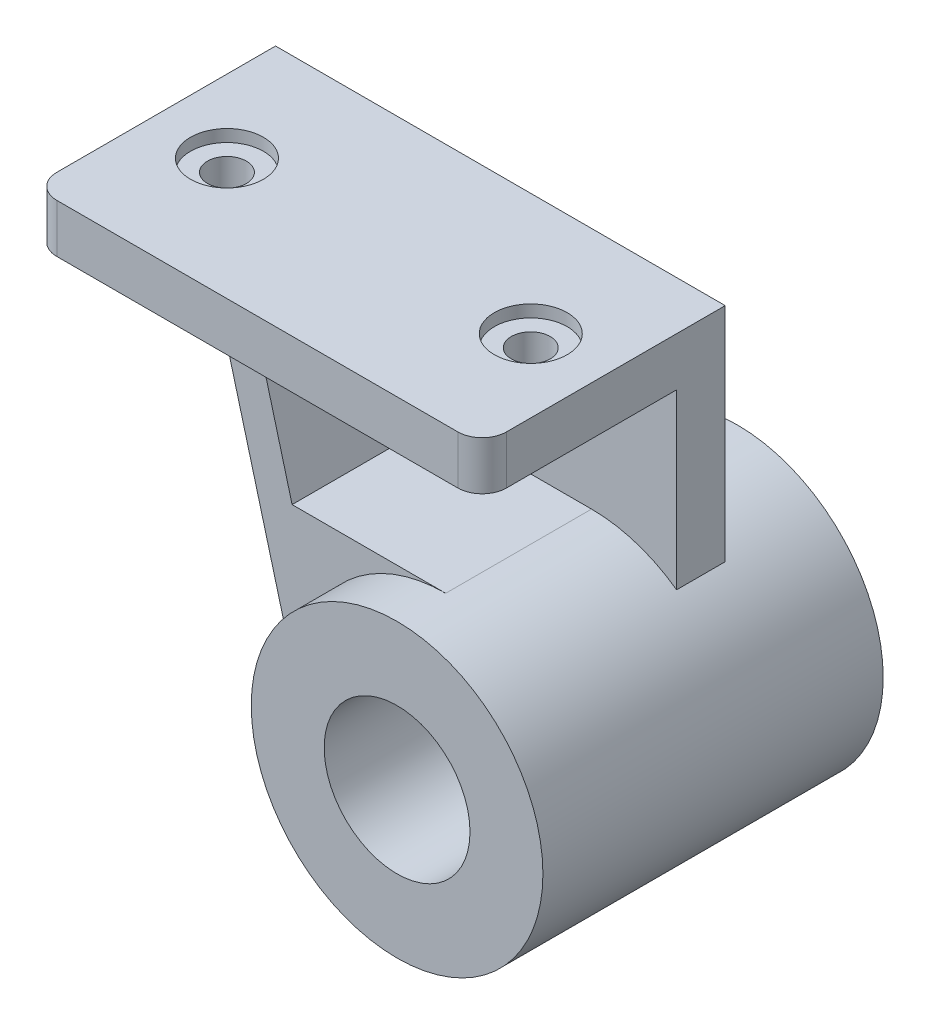
ISO-10303-21;
HEADER;
FILE_DESCRIPTION(('STEP AP214'),'2;1');
FILE_NAME('part.step','',(''),(''),'','','');
FILE_SCHEMA(('AUTOMOTIVE_DESIGN { 1 0 10303 214 1 1 1 1 }'));
ENDSEC;
DATA;
#1=APPLICATION_CONTEXT('core data for automotive mechanical design processes');
#2=APPLICATION_PROTOCOL_DEFINITION('international standard','automotive_design',2000,#1);
#3=PRODUCT_CONTEXT('',#1,'mechanical');
#4=PRODUCT('Part','Part','',(#3));
#5=PRODUCT_RELATED_PRODUCT_CATEGORY('part','',(#4));
#6=PRODUCT_DEFINITION_FORMATION('','',#4);
#7=PRODUCT_DEFINITION_CONTEXT('part definition',#1,'design');
#8=PRODUCT_DEFINITION('design','',#6,#7);
#9=PRODUCT_DEFINITION_SHAPE('','',#8);
#10=(LENGTH_UNIT() NAMED_UNIT(*) SI_UNIT(.MILLI.,.METRE.));
#11=(NAMED_UNIT(*) PLANE_ANGLE_UNIT() SI_UNIT($,.RADIAN.));
#12=(NAMED_UNIT(*) SI_UNIT($,.STERADIAN.) SOLID_ANGLE_UNIT());
#13=UNCERTAINTY_MEASURE_WITH_UNIT(LENGTH_MEASURE(1.E-05),#10,'distance_accuracy_value','');
#14=(GEOMETRIC_REPRESENTATION_CONTEXT(3) GLOBAL_UNCERTAINTY_ASSIGNED_CONTEXT((#13)) GLOBAL_UNIT_ASSIGNED_CONTEXT((#10,
#11,#12)) REPRESENTATION_CONTEXT('',''));
#15=CARTESIAN_POINT('',(0.,0.,0.));
#16=DIRECTION('',(0.,0.,1.));
#17=DIRECTION('',(1.,0.,0.));
#18=AXIS2_PLACEMENT_3D('',#15,#16,#17);
#19=CARTESIAN_POINT('',(0.,0.,70.));
#20=DIRECTION('',(0.,0.,-1.));
#21=DIRECTION('',(-1.,0.,0.));
#22=AXIS2_PLACEMENT_3D('',#19,#20,#21);
#23=CYLINDRICAL_SURFACE('',#22,60.);
#24=CARTESIAN_POINT('',(0.,0.,70.));
#25=DIRECTION('',(0.,0.,1.));
#26=DIRECTION('',(1.,0.,0.));
#27=AXIS2_PLACEMENT_3D('',#24,#25,#26);
#28=CIRCLE('',#27,60.);
#29=CARTESIAN_POINT('',(60.,0.,70.));
#30=VERTEX_POINT('',#29);
#31=EDGE_CURVE('E11',#30,#30,#28,.T.);
#32=ORIENTED_EDGE('',*,*,#31,.F.);
#33=EDGE_LOOP('',(#32));
#34=FACE_BOUND('',#33,.T.);
#35=CARTESIAN_POINT('',(0.,0.,-70.));
#36=DIRECTION('',(0.,0.,1.));
#37=DIRECTION('',(1.,0.,0.));
#38=AXIS2_PLACEMENT_3D('',#35,#36,#37);
#39=CIRCLE('',#38,60.);
#40=CARTESIAN_POINT('',(60.,0.,-70.));
#41=VERTEX_POINT('',#40);
#42=EDGE_CURVE('E39',#41,#41,#39,.T.);
#43=ORIENTED_EDGE('',*,*,#42,.T.);
#44=EDGE_LOOP('',(#43));
#45=FACE_BOUND('',#44,.T.);
#46=CARTESIAN_POINT('',(0.,0.,-9.99999999999999));
#47=DIRECTION('',(0.,0.,1.));
#48=DIRECTION('',(-1.,0.,0.));
#49=AXIS2_PLACEMENT_3D('',#46,#47,#48);
#50=CIRCLE('',#49,60.);
#51=CARTESIAN_POINT('',(-57.955549577344,-15.5291427061515,-9.99999999999999));
#52=VERTEX_POINT('',#51);
#53=CARTESIAN_POINT('',(-50.2405611529652,-32.8007014412065,-9.99999999999999));
#54=VERTEX_POINT('',#53);
#55=EDGE_CURVE('E149',#52,#54,#50,.T.);
#56=ORIENTED_EDGE('',*,*,#55,.T.);
#57=DIRECTION('',(0.,0.,1.));
#58=VECTOR('',#57,1.);
#59=CARTESIAN_POINT('',(-50.2405611529652,-32.8007014412065,-30.));
#60=LINE('',#59,#58);
#61=CARTESIAN_POINT('',(-50.2405611529652,-32.8007014412065,-30.));
#62=VERTEX_POINT('',#61);
#63=EDGE_CURVE('E153',#62,#54,#60,.T.);
#64=ORIENTED_EDGE('',*,*,#63,.F.);
#65=CARTESIAN_POINT('',(0.,0.,-30.));
#66=DIRECTION('',(0.,0.,1.));
#67=DIRECTION('',(-1.,0.,0.));
#68=AXIS2_PLACEMENT_3D('',#65,#66,#67);
#69=CIRCLE('',#68,60.);
#70=CARTESIAN_POINT('',(35.,48.7339717240448,-30.));
#71=VERTEX_POINT('',#70);
#72=EDGE_CURVE('E275',#71,#62,#69,.T.);
#73=ORIENTED_EDGE('',*,*,#72,.F.);
#74=DIRECTION('',(0.,0.,1.));
#75=VECTOR('',#74,1.);
#76=CARTESIAN_POINT('',(35.,48.7339717240448,-30.));
#77=LINE('',#76,#75);
#78=CARTESIAN_POINT('',(35.,48.7339717240448,-9.99999999999999));
#79=VERTEX_POINT('',#78);
#80=EDGE_CURVE('E181',#71,#79,#77,.T.);
#81=ORIENTED_EDGE('',*,*,#80,.T.);
#82=CARTESIAN_POINT('',(0.,60.,-9.99999999999999));
#83=VERTEX_POINT('',#82);
#84=EDGE_CURVE('E159',#79,#83,#50,.T.);
#85=ORIENTED_EDGE('',*,*,#84,.T.);
#86=DIRECTION('',(0.,0.,1.));
#87=VECTOR('',#86,1.);
#88=CARTESIAN_POINT('',(0.,60.,-9.99999999999999));
#89=LINE('',#88,#87);
#90=CARTESIAN_POINT('',(0.,60.,50.));
#91=VERTEX_POINT('',#90);
#92=EDGE_CURVE('E85',#83,#91,#89,.T.);
#93=ORIENTED_EDGE('',*,*,#92,.T.);
#94=CARTESIAN_POINT('',(0.,0.,50.));
#95=DIRECTION('',(0.,0.,-1.));
#96=DIRECTION('',(1.,0.,0.));
#97=AXIS2_PLACEMENT_3D('',#94,#95,#96);
#98=CIRCLE('',#97,60.);
#99=CARTESIAN_POINT('',(-57.9555495773441,-15.5291427061515,50.));
#100=VERTEX_POINT('',#99);
#101=EDGE_CURVE('E96',#100,#91,#98,.T.);
#102=ORIENTED_EDGE('',*,*,#101,.F.);
#103=DIRECTION('',(0.,0.,1.));
#104=VECTOR('',#103,1.);
#105=CARTESIAN_POINT('',(-57.955549577344,-15.5291427061515,-9.99999999999999));
#106=LINE('',#105,#104);
#107=EDGE_CURVE('E109',#52,#100,#106,.T.);
#108=ORIENTED_EDGE('',*,*,#107,.F.);
#109=EDGE_LOOP('',(#56,#64,#73,#81,#85,#93,#102,#108));
#110=FACE_BOUND('',#109,.T.);
#111=ADVANCED_FACE('F36',(#34,#45,#110),#23,.T.);
#112=CARTESIAN_POINT('',(0.,0.,70.));
#113=DIRECTION('',(0.,0.,1.));
#114=DIRECTION('',(1.,0.,0.));
#115=AXIS2_PLACEMENT_3D('',#112,#113,#114);
#116=PLANE('',#115);
#117=ORIENTED_EDGE('',*,*,#31,.T.);
#118=EDGE_LOOP('',(#117));
#119=FACE_BOUND('',#118,.T.);
#120=CARTESIAN_POINT('',(0.,0.,70.));
#121=DIRECTION('',(0.,0.,1.));
#122=DIRECTION('',(1.,0.,0.));
#123=AXIS2_PLACEMENT_3D('',#120,#121,#122);
#124=CIRCLE('',#123,30.);
#125=CARTESIAN_POINT('',(30.,0.,70.));
#126=VERTEX_POINT('',#125);
#127=EDGE_CURVE('E112',#126,#126,#124,.T.);
#128=ORIENTED_EDGE('',*,*,#127,.F.);
#129=EDGE_LOOP('',(#128));
#130=FACE_BOUND('',#129,.T.);
#131=ADVANCED_FACE('F131',(#119,#130),#116,.T.);
#132=CARTESIAN_POINT('',(0.,0.,-70.));
#133=DIRECTION('',(0.,0.,1.));
#134=DIRECTION('',(1.,0.,0.));
#135=AXIS2_PLACEMENT_3D('',#132,#133,#134);
#136=PLANE('',#135);
#137=ORIENTED_EDGE('',*,*,#42,.F.);
#138=EDGE_LOOP('',(#137));
#139=FACE_BOUND('',#138,.T.);
#140=CARTESIAN_POINT('',(0.,0.,-70.));
#141=DIRECTION('',(0.,0.,1.));
#142=DIRECTION('',(1.,0.,0.));
#143=AXIS2_PLACEMENT_3D('',#140,#141,#142);
#144=CIRCLE('',#143,30.);
#145=CARTESIAN_POINT('',(30.,0.,-70.));
#146=VERTEX_POINT('',#145);
#147=EDGE_CURVE('E106',#146,#146,#144,.T.);
#148=ORIENTED_EDGE('',*,*,#147,.T.);
#149=EDGE_LOOP('',(#148));
#150=FACE_BOUND('',#149,.T.);
#151=ADVANCED_FACE('F118',(#139,#150),#136,.F.);
#152=CARTESIAN_POINT('',(0.,0.,70.));
#153=DIRECTION('',(0.,0.,-1.));
#154=DIRECTION('',(-1.,0.,0.));
#155=AXIS2_PLACEMENT_3D('',#152,#153,#154);
#156=CYLINDRICAL_SURFACE('',#155,30.);
#157=ORIENTED_EDGE('',*,*,#127,.T.);
#158=EDGE_LOOP('',(#157));
#159=FACE_BOUND('',#158,.T.);
#160=ORIENTED_EDGE('',*,*,#147,.F.);
#161=EDGE_LOOP('',(#160));
#162=FACE_BOUND('',#161,.T.);
#163=ADVANCED_FACE('F120',(#159,#162),#156,.F.);
#164=CARTESIAN_POINT('',(-94.2704739163404,120.,-9.99999999999999));
#165=DIRECTION('',(-0.965925826289067,-0.258819045102525,0.));
#166=DIRECTION('',(0.258819045102525,-0.965925826289067,0.));
#167=AXIS2_PLACEMENT_3D('',#164,#165,#166);
#168=PLANE('',#167);
#169=DIRECTION('',(0.258819045102525,-0.965925826289067,0.));
#170=VECTOR('',#169,1.);
#171=CARTESIAN_POINT('',(-94.2704739163404,120.,50.));
#172=LINE('',#171,#170);
#173=CARTESIAN_POINT('',(-94.2704739163404,120.,50.));
#174=VERTEX_POINT('',#173);
#175=EDGE_CURVE('E50',#174,#100,#172,.T.);
#176=ORIENTED_EDGE('',*,*,#175,.F.);
#177=DIRECTION('',(0.,0.,1.));
#178=VECTOR('',#177,1.);
#179=CARTESIAN_POINT('',(-94.2704739163404,120.,-9.99999999999999));
#180=LINE('',#179,#178);
#181=CARTESIAN_POINT('',(-94.2704739163404,120.,-9.99999999999999));
#182=VERTEX_POINT('',#181);
#183=EDGE_CURVE('E103',#182,#174,#180,.T.);
#184=ORIENTED_EDGE('',*,*,#183,.F.);
#185=DIRECTION('',(0.258819045102525,-0.965925826289067,0.));
#186=VECTOR('',#185,1.);
#187=CARTESIAN_POINT('',(-94.2704739163404,120.,-9.99999999999999));
#188=LINE('',#187,#186);
#189=EDGE_CURVE('E59',#182,#52,#188,.T.);
#190=ORIENTED_EDGE('',*,*,#189,.T.);
#191=ORIENTED_EDGE('',*,*,#107,.T.);
#192=EDGE_LOOP('',(#176,#184,#190,#191));
#193=FACE_BOUND('',#192,.T.);
#194=ADVANCED_FACE('F122',(#193),#168,.T.);
#195=CARTESIAN_POINT('',(-63.1935223704727,60.,-9.99999999999999));
#196=DIRECTION('',(0.965925826289067,0.258819045102525,0.));
#197=DIRECTION('',(-0.258819045102525,0.965925826289067,0.));
#198=AXIS2_PLACEMENT_3D('',#195,#196,#197);
#199=PLANE('',#198);
#200=DIRECTION('',(-0.258819045102525,0.965925826289067,0.));
#201=VECTOR('',#200,1.);
#202=CARTESIAN_POINT('',(-63.1935223704727,60.,50.));
#203=LINE('',#202,#201);
#204=CARTESIAN_POINT('',(-63.1935223704727,60.,50.));
#205=VERTEX_POINT('',#204);
#206=CARTESIAN_POINT('',(-79.2704739163404,120.,50.));
#207=VERTEX_POINT('',#206);
#208=EDGE_CURVE('E88',#205,#207,#203,.T.);
#209=ORIENTED_EDGE('',*,*,#208,.F.);
#210=DIRECTION('',(0.,0.,1.));
#211=VECTOR('',#210,1.);
#212=CARTESIAN_POINT('',(-63.1935223704727,60.,-9.99999999999999));
#213=LINE('',#212,#211);
#214=CARTESIAN_POINT('',(-63.1935223704727,60.,-9.99999999999999));
#215=VERTEX_POINT('',#214);
#216=EDGE_CURVE('E74',#215,#205,#213,.T.);
#217=ORIENTED_EDGE('',*,*,#216,.F.);
#218=DIRECTION('',(-0.258819045102525,0.965925826289067,0.));
#219=VECTOR('',#218,1.);
#220=CARTESIAN_POINT('',(-63.1935223704727,60.,-9.99999999999999));
#221=LINE('',#220,#219);
#222=CARTESIAN_POINT('',(-79.2704739163404,120.,-9.99999999999999));
#223=VERTEX_POINT('',#222);
#224=EDGE_CURVE('E111',#215,#223,#221,.T.);
#225=ORIENTED_EDGE('',*,*,#224,.T.);
#226=DIRECTION('',(0.,0.,1.));
#227=VECTOR('',#226,1.);
#228=CARTESIAN_POINT('',(-79.2704739163404,120.,-9.99999999999999));
#229=LINE('',#228,#227);
#230=EDGE_CURVE('E84',#223,#207,#229,.T.);
#231=ORIENTED_EDGE('',*,*,#230,.T.);
#232=EDGE_LOOP('',(#209,#217,#225,#231));
#233=FACE_BOUND('',#232,.T.);
#234=ADVANCED_FACE('F89',(#233),#199,.T.);
#235=CARTESIAN_POINT('',(0.,60.,-9.99999999999999));
#236=DIRECTION('',(0.,1.,0.));
#237=DIRECTION('',(-1.,0.,0.));
#238=AXIS2_PLACEMENT_3D('',#235,#236,#237);
#239=PLANE('',#238);
#240=DIRECTION('',(-1.,0.,0.));
#241=VECTOR('',#240,1.);
#242=CARTESIAN_POINT('',(0.,60.,50.));
#243=LINE('',#242,#241);
#244=EDGE_CURVE('E79',#91,#205,#243,.T.);
#245=ORIENTED_EDGE('',*,*,#244,.F.);
#246=ORIENTED_EDGE('',*,*,#92,.F.);
#247=DIRECTION('',(-1.,0.,0.));
#248=VECTOR('',#247,1.);
#249=CARTESIAN_POINT('',(0.,60.,-9.99999999999999));
#250=LINE('',#249,#248);
#251=EDGE_CURVE('E81',#83,#215,#250,.T.);
#252=ORIENTED_EDGE('',*,*,#251,.T.);
#253=ORIENTED_EDGE('',*,*,#216,.T.);
#254=EDGE_LOOP('',(#245,#246,#252,#253));
#255=FACE_BOUND('',#254,.T.);
#256=ADVANCED_FACE('F76',(#255),#239,.T.);
#257=CARTESIAN_POINT('',(0.,0.,50.));
#258=DIRECTION('',(0.,0.,1.));
#259=DIRECTION('',(1.,0.,0.));
#260=AXIS2_PLACEMENT_3D('',#257,#258,#259);
#261=PLANE('',#260);
#262=ORIENTED_EDGE('',*,*,#175,.T.);
#263=ORIENTED_EDGE('',*,*,#101,.T.);
#264=ORIENTED_EDGE('',*,*,#244,.T.);
#265=ORIENTED_EDGE('',*,*,#208,.T.);
#266=DIRECTION('',(-1.,0.,0.));
#267=VECTOR('',#266,1.);
#268=CARTESIAN_POINT('',(-94.2704739163404,120.,50.));
#269=LINE('',#268,#267);
#270=EDGE_CURVE('E92',#207,#174,#269,.T.);
#271=ORIENTED_EDGE('',*,*,#270,.T.);
#272=EDGE_LOOP('',(#262,#263,#264,#265,#271));
#273=FACE_BOUND('',#272,.T.);
#274=ADVANCED_FACE('F94',(#273),#261,.T.);
#275=CARTESIAN_POINT('',(0.,0.,-9.99999999999999));
#276=DIRECTION('',(0.,0.,-1.));
#277=DIRECTION('',(-1.,0.,0.));
#278=AXIS2_PLACEMENT_3D('',#275,#276,#277);
#279=PLANE('',#278);
#280=ORIENTED_EDGE('',*,*,#189,.F.);
#281=DIRECTION('',(1.,0.,0.));
#282=VECTOR('',#281,1.);
#283=CARTESIAN_POINT('',(-150.,120.,-9.99999999999999));
#284=LINE('',#283,#282);
#285=CARTESIAN_POINT('',(-150.,120.,-9.99999999999999));
#286=VERTEX_POINT('',#285);
#287=EDGE_CURVE('E172',#286,#182,#284,.T.);
#288=ORIENTED_EDGE('',*,*,#287,.F.);
#289=DIRECTION('',(-0.546678357353441,0.837342685882753,0.));
#290=VECTOR('',#289,1.);
#291=CARTESIAN_POINT('',(-150.,120.,-9.99999999999999));
#292=LINE('',#291,#290);
#293=EDGE_CURVE('E163',#54,#286,#292,.T.);
#294=ORIENTED_EDGE('',*,*,#293,.F.);
#295=ORIENTED_EDGE('',*,*,#55,.F.);
#296=EDGE_LOOP('',(#280,#288,#294,#295));
#297=FACE_BOUND('',#296,.T.);
#298=ADVANCED_FACE('F386',(#297),#279,.F.);
#299=CARTESIAN_POINT('',(35.,120.,-30.));
#300=DIRECTION('',(-1.,0.,0.));
#301=DIRECTION('',(0.,0.,1.));
#302=AXIS2_PLACEMENT_3D('',#299,#300,#301);
#303=PLANE('',#302);
#304=DIRECTION('',(0.,-1.,0.));
#305=VECTOR('',#304,1.);
#306=CARTESIAN_POINT('',(35.,120.,-9.99999999999999));
#307=LINE('',#306,#305);
#308=CARTESIAN_POINT('',(35.,120.,-9.99999999999999));
#309=VERTEX_POINT('',#308);
#310=EDGE_CURVE('E160',#309,#79,#307,.T.);
#311=ORIENTED_EDGE('',*,*,#310,.T.);
#312=ORIENTED_EDGE('',*,*,#80,.F.);
#313=DIRECTION('',(0.,-1.,0.));
#314=VECTOR('',#313,1.);
#315=CARTESIAN_POINT('',(35.,120.,-30.));
#316=LINE('',#315,#314);
#317=CARTESIAN_POINT('',(35.,140.,-30.));
#318=VERTEX_POINT('',#317);
#319=EDGE_CURVE('E175',#318,#71,#316,.T.);
#320=ORIENTED_EDGE('',*,*,#319,.F.);
#321=DIRECTION('',(0.,0.,-1.));
#322=VECTOR('',#321,1.);
#323=CARTESIAN_POINT('',(35.,140.,59.9999999999999));
#324=LINE('',#323,#322);
#325=CARTESIAN_POINT('',(35.,140.,59.9999999999999));
#326=VERTEX_POINT('',#325);
#327=EDGE_CURVE('E262',#326,#318,#324,.T.);
#328=ORIENTED_EDGE('',*,*,#327,.F.);
#329=DIRECTION('',(0.,-1.,0.));
#330=VECTOR('',#329,1.);
#331=CARTESIAN_POINT('',(35.,140.,59.9999999999999));
#332=LINE('',#331,#330);
#333=CARTESIAN_POINT('',(35.,120.,59.9999999999999));
#334=VERTEX_POINT('',#333);
#335=EDGE_CURVE('E299',#326,#334,#332,.T.);
#336=ORIENTED_EDGE('',*,*,#335,.T.);
#337=DIRECTION('',(0.,0.,-1.));
#338=VECTOR('',#337,1.);
#339=CARTESIAN_POINT('',(35.,120.,59.9999999999999));
#340=LINE('',#339,#338);
#341=EDGE_CURVE('E264',#334,#309,#340,.T.);
#342=ORIENTED_EDGE('',*,*,#341,.T.);
#343=EDGE_LOOP('',(#311,#312,#320,#328,#336,#342));
#344=FACE_BOUND('',#343,.T.);
#345=ADVANCED_FACE('F389',(#344),#303,.F.);
#346=CARTESIAN_POINT('',(-150.,120.,-30.));
#347=DIRECTION('',(0.837342685882753,0.546678357353441,0.));
#348=DIRECTION('',(-0.546678357353441,0.837342685882753,0.));
#349=AXIS2_PLACEMENT_3D('',#346,#347,#348);
#350=PLANE('',#349);
#351=ORIENTED_EDGE('',*,*,#293,.T.);
#352=DIRECTION('',(0.,0.,1.));
#353=VECTOR('',#352,1.);
#354=CARTESIAN_POINT('',(-150.,120.,-30.));
#355=LINE('',#354,#353);
#356=CARTESIAN_POINT('',(-150.,120.,-30.));
#357=VERTEX_POINT('',#356);
#358=EDGE_CURVE('E176',#357,#286,#355,.T.);
#359=ORIENTED_EDGE('',*,*,#358,.F.);
#360=DIRECTION('',(-0.546678357353441,0.837342685882753,0.));
#361=VECTOR('',#360,1.);
#362=CARTESIAN_POINT('',(-150.,120.,-30.));
#363=LINE('',#362,#361);
#364=EDGE_CURVE('E179',#62,#357,#363,.T.);
#365=ORIENTED_EDGE('',*,*,#364,.F.);
#366=ORIENTED_EDGE('',*,*,#63,.T.);
#367=EDGE_LOOP('',(#351,#359,#365,#366));
#368=FACE_BOUND('',#367,.T.);
#369=ADVANCED_FACE('F278',(#368),#350,.F.);
#370=CARTESIAN_POINT('',(0.,0.,-30.));
#371=DIRECTION('',(0.,0.,-1.));
#372=DIRECTION('',(-1.,0.,0.));
#373=AXIS2_PLACEMENT_3D('',#370,#371,#372);
#374=PLANE('',#373);
#375=ORIENTED_EDGE('',*,*,#319,.T.);
#376=ORIENTED_EDGE('',*,*,#72,.T.);
#377=ORIENTED_EDGE('',*,*,#364,.T.);
#378=DIRECTION('',(0.,-1.,0.));
#379=VECTOR('',#378,1.);
#380=CARTESIAN_POINT('',(-150.,140.,-30.));
#381=LINE('',#380,#379);
#382=CARTESIAN_POINT('',(-150.,140.,-30.));
#383=VERTEX_POINT('',#382);
#384=EDGE_CURVE('E165',#383,#357,#381,.T.);
#385=ORIENTED_EDGE('',*,*,#384,.F.);
#386=DIRECTION('',(-1.,0.,0.));
#387=VECTOR('',#386,1.);
#388=CARTESIAN_POINT('',(35.,140.,-30.));
#389=LINE('',#388,#387);
#390=EDGE_CURVE('E256',#318,#383,#389,.T.);
#391=ORIENTED_EDGE('',*,*,#390,.F.);
#392=EDGE_LOOP('',(#375,#376,#377,#385,#391));
#393=FACE_BOUND('',#392,.T.);
#394=ADVANCED_FACE('F266',(#393),#374,.T.);
#395=ORIENTED_EDGE('',*,*,#224,.F.);
#396=ORIENTED_EDGE('',*,*,#251,.F.);
#397=ORIENTED_EDGE('',*,*,#84,.F.);
#398=ORIENTED_EDGE('',*,*,#310,.F.);
#399=EDGE_CURVE('E171',#223,#309,#284,.T.);
#400=ORIENTED_EDGE('',*,*,#399,.F.);
#401=EDGE_LOOP('',(#395,#396,#397,#398,#400));
#402=FACE_BOUND('',#401,.T.);
#403=ADVANCED_FACE('F371',(#402),#279,.F.);
#404=CARTESIAN_POINT('',(-140.,120.,60.));
#405=DIRECTION('',(0.,1.,0.));
#406=DIRECTION('',(-1.,0.,0.));
#407=AXIS2_PLACEMENT_3D('',#404,#405,#406);
#408=PLANE('',#407);
#409=CARTESIAN_POINT('',(-120.,120.,20.));
#410=DIRECTION('',(0.,1.,0.));
#411=DIRECTION('',(0.,0.,1.));
#412=AXIS2_PLACEMENT_3D('',#409,#410,#411);
#413=CIRCLE('',#412,7.99999999999999);
#414=CARTESIAN_POINT('',(-120.,120.,28.));
#415=VERTEX_POINT('',#414);
#416=EDGE_CURVE('E326',#415,#415,#413,.T.);
#417=ORIENTED_EDGE('',*,*,#416,.T.);
#418=EDGE_LOOP('',(#417));
#419=FACE_BOUND('',#418,.T.);
#420=CARTESIAN_POINT('',(5.00000000000005,120.,20.));
#421=DIRECTION('',(0.,1.,0.));
#422=DIRECTION('',(0.,0.,1.));
#423=AXIS2_PLACEMENT_3D('',#420,#421,#422);
#424=CIRCLE('',#423,8.);
#425=CARTESIAN_POINT('',(5.00000000000005,120.,28.));
#426=VERTEX_POINT('',#425);
#427=EDGE_CURVE('E283',#426,#426,#424,.T.);
#428=ORIENTED_EDGE('',*,*,#427,.T.);
#429=EDGE_LOOP('',(#428));
#430=FACE_BOUND('',#429,.T.);
#431=ORIENTED_EDGE('',*,*,#230,.F.);
#432=ORIENTED_EDGE('',*,*,#399,.T.);
#433=ORIENTED_EDGE('',*,*,#341,.F.);
#434=CARTESIAN_POINT('',(25.,120.,60.));
#435=DIRECTION('',(0.,1.,0.));
#436=DIRECTION('',(-1.,0.,0.));
#437=AXIS2_PLACEMENT_3D('',#434,#435,#436);
#438=CIRCLE('',#437,10.);
#439=CARTESIAN_POINT('',(25.,120.,70.));
#440=VERTEX_POINT('',#439);
#441=EDGE_CURVE('E293',#440,#334,#438,.T.);
#442=ORIENTED_EDGE('',*,*,#441,.F.);
#443=DIRECTION('',(1.,0.,0.));
#444=VECTOR('',#443,1.);
#445=CARTESIAN_POINT('',(-140.,120.,70.));
#446=LINE('',#445,#444);
#447=CARTESIAN_POINT('',(-140.,120.,70.));
#448=VERTEX_POINT('',#447);
#449=EDGE_CURVE('E291',#448,#440,#446,.T.);
#450=ORIENTED_EDGE('',*,*,#449,.F.);
#451=CARTESIAN_POINT('',(-140.,120.,60.));
#452=DIRECTION('',(0.,1.,0.));
#453=DIRECTION('',(-1.,0.,0.));
#454=AXIS2_PLACEMENT_3D('',#451,#452,#453);
#455=CIRCLE('',#454,10.);
#456=CARTESIAN_POINT('',(-150.,120.,59.9999999999999));
#457=VERTEX_POINT('',#456);
#458=EDGE_CURVE('E282',#457,#448,#455,.T.);
#459=ORIENTED_EDGE('',*,*,#458,.F.);
#460=DIRECTION('',(0.,0.,1.));
#461=VECTOR('',#460,1.);
#462=CARTESIAN_POINT('',(-150.,120.,-30.));
#463=LINE('',#462,#461);
#464=EDGE_CURVE('E280',#286,#457,#463,.T.);
#465=ORIENTED_EDGE('',*,*,#464,.F.);
#466=ORIENTED_EDGE('',*,*,#287,.T.);
#467=ORIENTED_EDGE('',*,*,#183,.T.);
#468=ORIENTED_EDGE('',*,*,#270,.F.);
#469=EDGE_LOOP('',(#431,#432,#433,#442,#450,#459,#465,#466,#467,#468));
#470=FACE_BOUND('',#469,.T.);
#471=ADVANCED_FACE('F195',(#419,#430,#470),#408,.F.);
#472=CARTESIAN_POINT('',(-150.,140.,-30.));
#473=DIRECTION('',(1.,0.,0.));
#474=DIRECTION('',(0.,1.,0.));
#475=AXIS2_PLACEMENT_3D('',#472,#473,#474);
#476=PLANE('',#475);
#477=ORIENTED_EDGE('',*,*,#358,.T.);
#478=ORIENTED_EDGE('',*,*,#464,.T.);
#479=DIRECTION('',(0.,-1.,0.));
#480=VECTOR('',#479,1.);
#481=CARTESIAN_POINT('',(-150.,140.,59.9999999999999));
#482=LINE('',#481,#480);
#483=CARTESIAN_POINT('',(-150.,140.,59.9999999999999));
#484=VERTEX_POINT('',#483);
#485=EDGE_CURVE('E252',#484,#457,#482,.T.);
#486=ORIENTED_EDGE('',*,*,#485,.F.);
#487=DIRECTION('',(0.,0.,1.));
#488=VECTOR('',#487,1.);
#489=CARTESIAN_POINT('',(-150.,140.,-30.));
#490=LINE('',#489,#488);
#491=EDGE_CURVE('E247',#383,#484,#490,.T.);
#492=ORIENTED_EDGE('',*,*,#491,.F.);
#493=ORIENTED_EDGE('',*,*,#384,.T.);
#494=EDGE_LOOP('',(#477,#478,#486,#492,#493));
#495=FACE_BOUND('',#494,.T.);
#496=ADVANCED_FACE('F249',(#495),#476,.F.);
#497=CARTESIAN_POINT('',(-140.,140.,60.));
#498=DIRECTION('',(0.,-1.,0.));
#499=DIRECTION('',(1.,0.,0.));
#500=AXIS2_PLACEMENT_3D('',#497,#498,#499);
#501=CYLINDRICAL_SURFACE('',#500,10.);
#502=ORIENTED_EDGE('',*,*,#458,.T.);
#503=DIRECTION('',(0.,-1.,0.));
#504=VECTOR('',#503,1.);
#505=CARTESIAN_POINT('',(-140.,140.,70.));
#506=LINE('',#505,#504);
#507=CARTESIAN_POINT('',(-140.,140.,70.));
#508=VERTEX_POINT('',#507);
#509=EDGE_CURVE('E270',#508,#448,#506,.T.);
#510=ORIENTED_EDGE('',*,*,#509,.F.);
#511=CARTESIAN_POINT('',(-140.,140.,60.));
#512=DIRECTION('',(0.,1.,0.));
#513=DIRECTION('',(-1.,0.,0.));
#514=AXIS2_PLACEMENT_3D('',#511,#512,#513);
#515=CIRCLE('',#514,10.);
#516=EDGE_CURVE('E255',#484,#508,#515,.T.);
#517=ORIENTED_EDGE('',*,*,#516,.F.);
#518=ORIENTED_EDGE('',*,*,#485,.T.);
#519=EDGE_LOOP('',(#502,#510,#517,#518));
#520=FACE_BOUND('',#519,.T.);
#521=ADVANCED_FACE('F286',(#520),#501,.T.);
#522=CARTESIAN_POINT('',(-140.,140.,70.));
#523=DIRECTION('',(0.,0.,-1.));
#524=DIRECTION('',(-1.,0.,0.));
#525=AXIS2_PLACEMENT_3D('',#522,#523,#524);
#526=PLANE('',#525);
#527=ORIENTED_EDGE('',*,*,#449,.T.);
#528=DIRECTION('',(0.,-1.,0.));
#529=VECTOR('',#528,1.);
#530=CARTESIAN_POINT('',(25.,140.,70.));
#531=LINE('',#530,#529);
#532=CARTESIAN_POINT('',(25.,140.,70.));
#533=VERTEX_POINT('',#532);
#534=EDGE_CURVE('E302',#533,#440,#531,.T.);
#535=ORIENTED_EDGE('',*,*,#534,.F.);
#536=DIRECTION('',(1.,0.,0.));
#537=VECTOR('',#536,1.);
#538=CARTESIAN_POINT('',(-140.,140.,70.));
#539=LINE('',#538,#537);
#540=EDGE_CURVE('E308',#508,#533,#539,.T.);
#541=ORIENTED_EDGE('',*,*,#540,.F.);
#542=ORIENTED_EDGE('',*,*,#509,.T.);
#543=EDGE_LOOP('',(#527,#535,#541,#542));
#544=FACE_BOUND('',#543,.T.);
#545=ADVANCED_FACE('F306',(#544),#526,.F.);
#546=CARTESIAN_POINT('',(25.,140.,60.));
#547=DIRECTION('',(0.,-1.,0.));
#548=DIRECTION('',(1.,0.,0.));
#549=AXIS2_PLACEMENT_3D('',#546,#547,#548);
#550=CYLINDRICAL_SURFACE('',#549,10.);
#551=ORIENTED_EDGE('',*,*,#441,.T.);
#552=ORIENTED_EDGE('',*,*,#335,.F.);
#553=CARTESIAN_POINT('',(25.,140.,60.));
#554=DIRECTION('',(0.,1.,0.));
#555=DIRECTION('',(-1.,0.,0.));
#556=AXIS2_PLACEMENT_3D('',#553,#554,#555);
#557=CIRCLE('',#556,10.);
#558=EDGE_CURVE('E310',#533,#326,#557,.T.);
#559=ORIENTED_EDGE('',*,*,#558,.F.);
#560=ORIENTED_EDGE('',*,*,#534,.T.);
#561=EDGE_LOOP('',(#551,#552,#559,#560));
#562=FACE_BOUND('',#561,.T.);
#563=ADVANCED_FACE('F344',(#562),#550,.T.);
#564=CARTESIAN_POINT('',(-140.,140.,60.));
#565=DIRECTION('',(0.,1.,0.));
#566=DIRECTION('',(-1.,0.,0.));
#567=AXIS2_PLACEMENT_3D('',#564,#565,#566);
#568=PLANE('',#567);
#569=CARTESIAN_POINT('',(-120.,140.,20.));
#570=DIRECTION('',(0.,1.,0.));
#571=DIRECTION('',(0.,0.,1.));
#572=AXIS2_PLACEMENT_3D('',#569,#570,#571);
#573=CIRCLE('',#572,15.);
#574=CARTESIAN_POINT('',(-120.,140.,35.));
#575=VERTEX_POINT('',#574);
#576=EDGE_CURVE('E335',#575,#575,#573,.T.);
#577=ORIENTED_EDGE('',*,*,#576,.F.);
#578=EDGE_LOOP('',(#577));
#579=FACE_BOUND('',#578,.T.);
#580=CARTESIAN_POINT('',(5.00000000000005,140.,20.));
#581=DIRECTION('',(0.,1.,0.));
#582=DIRECTION('',(0.,0.,1.));
#583=AXIS2_PLACEMENT_3D('',#580,#581,#582);
#584=CIRCLE('',#583,15.);
#585=CARTESIAN_POINT('',(5.00000000000005,140.,35.));
#586=VERTEX_POINT('',#585);
#587=EDGE_CURVE('E323',#586,#586,#584,.T.);
#588=ORIENTED_EDGE('',*,*,#587,.F.);
#589=EDGE_LOOP('',(#588));
#590=FACE_BOUND('',#589,.T.);
#591=ORIENTED_EDGE('',*,*,#390,.T.);
#592=ORIENTED_EDGE('',*,*,#491,.T.);
#593=ORIENTED_EDGE('',*,*,#516,.T.);
#594=ORIENTED_EDGE('',*,*,#540,.T.);
#595=ORIENTED_EDGE('',*,*,#558,.T.);
#596=ORIENTED_EDGE('',*,*,#327,.T.);
#597=EDGE_LOOP('',(#591,#592,#593,#594,#595,#596));
#598=FACE_BOUND('',#597,.T.);
#599=ADVANCED_FACE('F260',(#579,#590,#598),#568,.T.);
#600=CARTESIAN_POINT('',(5.00000000000005,140.,20.));
#601=DIRECTION('',(0.,1.,0.));
#602=DIRECTION('',(0.,0.,1.));
#603=AXIS2_PLACEMENT_3D('',#600,#601,#602);
#604=CYLINDRICAL_SURFACE('',#603,7.99999999999999);
#605=ORIENTED_EDGE('',*,*,#427,.F.);
#606=EDGE_LOOP('',(#605));
#607=FACE_BOUND('',#606,.T.);
#608=CARTESIAN_POINT('',(5.00000000000005,135.,20.));
#609=DIRECTION('',(0.,1.,0.));
#610=DIRECTION('',(0.,0.,1.));
#611=AXIS2_PLACEMENT_3D('',#608,#609,#610);
#612=CIRCLE('',#611,7.99999999999998);
#613=CARTESIAN_POINT('',(5.00000000000005,135.,28.));
#614=VERTEX_POINT('',#613);
#615=EDGE_CURVE('E317',#614,#614,#612,.T.);
#616=ORIENTED_EDGE('',*,*,#615,.T.);
#617=EDGE_LOOP('',(#616));
#618=FACE_BOUND('',#617,.T.);
#619=ADVANCED_FACE('F343',(#607,#618),#604,.F.);
#620=CARTESIAN_POINT('',(13.,135.,20.));
#621=DIRECTION('',(0.,-1.,0.));
#622=DIRECTION('',(0.,0.,-1.));
#623=AXIS2_PLACEMENT_3D('',#620,#621,#622);
#624=PLANE('',#623);
#625=ORIENTED_EDGE('',*,*,#615,.F.);
#626=EDGE_LOOP('',(#625));
#627=FACE_BOUND('',#626,.T.);
#628=CARTESIAN_POINT('',(5.00000000000005,135.,20.));
#629=DIRECTION('',(0.,1.,0.));
#630=DIRECTION('',(0.,0.,1.));
#631=AXIS2_PLACEMENT_3D('',#628,#629,#630);
#632=CIRCLE('',#631,15.);
#633=CARTESIAN_POINT('',(5.00000000000005,135.,35.));
#634=VERTEX_POINT('',#633);
#635=EDGE_CURVE('E320',#634,#634,#632,.T.);
#636=ORIENTED_EDGE('',*,*,#635,.T.);
#637=EDGE_LOOP('',(#636));
#638=FACE_BOUND('',#637,.T.);
#639=ADVANCED_FACE('F351',(#627,#638),#624,.F.);
#640=CARTESIAN_POINT('',(5.00000000000005,140.,20.));
#641=DIRECTION('',(0.,1.,0.));
#642=DIRECTION('',(0.,0.,1.));
#643=AXIS2_PLACEMENT_3D('',#640,#641,#642);
#644=CYLINDRICAL_SURFACE('',#643,15.);
#645=ORIENTED_EDGE('',*,*,#635,.F.);
#646=EDGE_LOOP('',(#645));
#647=FACE_BOUND('',#646,.T.);
#648=ORIENTED_EDGE('',*,*,#587,.T.);
#649=EDGE_LOOP('',(#648));
#650=FACE_BOUND('',#649,.T.);
#651=ADVANCED_FACE('F348',(#647,#650),#644,.F.);
#652=CARTESIAN_POINT('',(-120.,140.,20.));
#653=DIRECTION('',(0.,1.,0.));
#654=DIRECTION('',(0.,0.,1.));
#655=AXIS2_PLACEMENT_3D('',#652,#653,#654);
#656=CYLINDRICAL_SURFACE('',#655,7.99999999999999);
#657=ORIENTED_EDGE('',*,*,#416,.F.);
#658=EDGE_LOOP('',(#657));
#659=FACE_BOUND('',#658,.T.);
#660=CARTESIAN_POINT('',(-120.,135.,20.));
#661=DIRECTION('',(0.,1.,0.));
#662=DIRECTION('',(0.,0.,1.));
#663=AXIS2_PLACEMENT_3D('',#660,#661,#662);
#664=CIRCLE('',#663,7.99999999999998);
#665=CARTESIAN_POINT('',(-120.,135.,28.));
#666=VERTEX_POINT('',#665);
#667=EDGE_CURVE('E329',#666,#666,#664,.T.);
#668=ORIENTED_EDGE('',*,*,#667,.T.);
#669=EDGE_LOOP('',(#668));
#670=FACE_BOUND('',#669,.T.);
#671=ADVANCED_FACE('F350',(#659,#670),#656,.F.);
#672=CARTESIAN_POINT('',(-112.,135.,20.));
#673=DIRECTION('',(0.,-1.,0.));
#674=DIRECTION('',(0.,0.,-1.));
#675=AXIS2_PLACEMENT_3D('',#672,#673,#674);
#676=PLANE('',#675);
#677=ORIENTED_EDGE('',*,*,#667,.F.);
#678=EDGE_LOOP('',(#677));
#679=FACE_BOUND('',#678,.T.);
#680=CARTESIAN_POINT('',(-120.,135.,20.));
#681=DIRECTION('',(0.,1.,0.));
#682=DIRECTION('',(0.,0.,1.));
#683=AXIS2_PLACEMENT_3D('',#680,#681,#682);
#684=CIRCLE('',#683,15.);
#685=CARTESIAN_POINT('',(-120.,135.,35.));
#686=VERTEX_POINT('',#685);
#687=EDGE_CURVE('E332',#686,#686,#684,.T.);
#688=ORIENTED_EDGE('',*,*,#687,.T.);
#689=EDGE_LOOP('',(#688));
#690=FACE_BOUND('',#689,.T.);
#691=ADVANCED_FACE('F358',(#679,#690),#676,.F.);
#692=CARTESIAN_POINT('',(-120.,140.,20.));
#693=DIRECTION('',(0.,1.,0.));
#694=DIRECTION('',(0.,0.,1.));
#695=AXIS2_PLACEMENT_3D('',#692,#693,#694);
#696=CYLINDRICAL_SURFACE('',#695,15.);
#697=ORIENTED_EDGE('',*,*,#687,.F.);
#698=EDGE_LOOP('',(#697));
#699=FACE_BOUND('',#698,.T.);
#700=ORIENTED_EDGE('',*,*,#576,.T.);
#701=EDGE_LOOP('',(#700));
#702=FACE_BOUND('',#701,.T.);
#703=ADVANCED_FACE('F339',(#699,#702),#696,.F.);
#704=CLOSED_SHELL('',(#111,#131,#151,#163,#194,#234,#256,#274,#298,#345,#369,#394,#403,#471,
#496,#521,#545,#563,#599,#619,#639,#651,#671,#691,#703));
#705=MANIFOLD_SOLID_BREP('B2',#704);
#706=ADVANCED_BREP_SHAPE_REPRESENTATION('',(#18,#705),#14);
#707=SHAPE_DEFINITION_REPRESENTATION(#9,#706);
ENDSEC;
END-ISO-10303-21;
